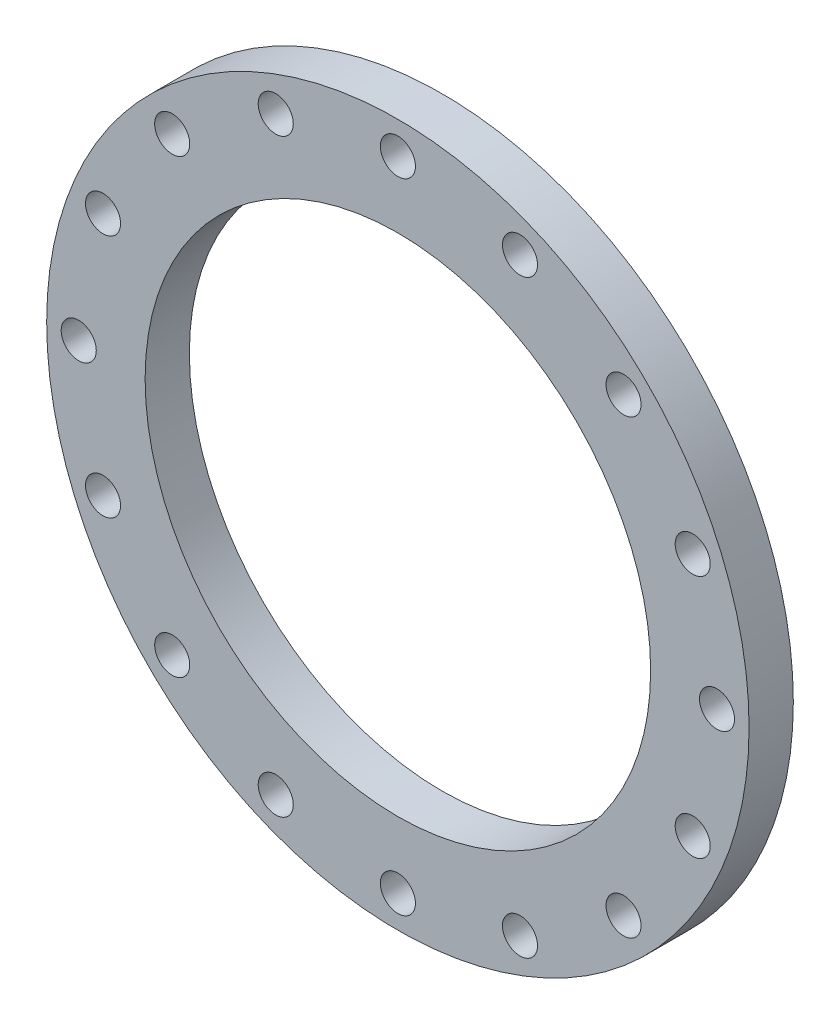
ISO-10303-21;
HEADER;
FILE_DESCRIPTION(('STEP AP214'),'2;1');
FILE_NAME('part.step','',(''),(''),'','','');
FILE_SCHEMA(('AUTOMOTIVE_DESIGN { 1 0 10303 214 1 1 1 1 }'));
ENDSEC;
DATA;
#1=APPLICATION_CONTEXT('core data for automotive mechanical design processes');
#2=APPLICATION_PROTOCOL_DEFINITION('international standard','automotive_design',2000,#1);
#3=PRODUCT_CONTEXT('',#1,'mechanical');
#4=PRODUCT('Part','Part','',(#3));
#5=PRODUCT_RELATED_PRODUCT_CATEGORY('part','',(#4));
#6=PRODUCT_DEFINITION_FORMATION('','',#4);
#7=PRODUCT_DEFINITION_CONTEXT('part definition',#1,'design');
#8=PRODUCT_DEFINITION('design','',#6,#7);
#9=PRODUCT_DEFINITION_SHAPE('','',#8);
#10=(LENGTH_UNIT() NAMED_UNIT(*) SI_UNIT(.MILLI.,.METRE.));
#11=(NAMED_UNIT(*) PLANE_ANGLE_UNIT() SI_UNIT($,.RADIAN.));
#12=(NAMED_UNIT(*) SI_UNIT($,.STERADIAN.) SOLID_ANGLE_UNIT());
#13=UNCERTAINTY_MEASURE_WITH_UNIT(LENGTH_MEASURE(1.E-05),#10,'distance_accuracy_value','');
#14=(GEOMETRIC_REPRESENTATION_CONTEXT(3) GLOBAL_UNCERTAINTY_ASSIGNED_CONTEXT((#13)) GLOBAL_UNIT_ASSIGNED_CONTEXT((#10,
#11,#12)) REPRESENTATION_CONTEXT('',''));
#15=CARTESIAN_POINT('',(0.,0.,0.));
#16=DIRECTION('',(0.,0.,1.));
#17=DIRECTION('',(1.,0.,0.));
#18=AXIS2_PLACEMENT_3D('',#15,#16,#17);
#19=CARTESIAN_POINT('',(0.,0.,40.));
#20=DIRECTION('',(0.,0.,1.));
#21=DIRECTION('',(1.,0.,0.));
#22=AXIS2_PLACEMENT_3D('',#19,#20,#21);
#23=PLANE('',#22);
#24=CARTESIAN_POINT('',(-204.000306372319,204.000306372319,40.));
#25=DIRECTION('',(0.,0.,1.));
#26=DIRECTION('',(1.,0.,0.));
#27=AXIS2_PLACEMENT_3D('',#24,#25,#26);
#28=CIRCLE('',#27,15.85);
#29=CARTESIAN_POINT('',(-188.150306372319,204.000306372319,40.));
#30=VERTEX_POINT('',#29);
#31=EDGE_CURVE('E134',#30,#30,#28,.T.);
#32=ORIENTED_EDGE('',*,*,#31,.F.);
#33=EDGE_LOOP('',(#32));
#34=FACE_BOUND('',#33,.T.);
#35=CARTESIAN_POINT('',(-288.5,0.,40.));
#36=DIRECTION('',(0.,0.,1.));
#37=DIRECTION('',(1.,0.,0.));
#38=AXIS2_PLACEMENT_3D('',#35,#36,#37);
#39=CIRCLE('',#38,15.85);
#40=CARTESIAN_POINT('',(-272.65,0.,40.));
#41=VERTEX_POINT('',#40);
#42=EDGE_CURVE('E122',#41,#41,#39,.T.);
#43=ORIENTED_EDGE('',*,*,#42,.F.);
#44=EDGE_LOOP('',(#43));
#45=FACE_BOUND('',#44,.T.);
#46=CARTESIAN_POINT('',(-204.000306372319,-204.000306372319,40.));
#47=DIRECTION('',(0.,0.,1.));
#48=DIRECTION('',(1.,0.,0.));
#49=AXIS2_PLACEMENT_3D('',#46,#47,#48);
#50=CIRCLE('',#49,15.85);
#51=CARTESIAN_POINT('',(-188.150306372319,-204.000306372319,40.));
#52=VERTEX_POINT('',#51);
#53=EDGE_CURVE('E110',#52,#52,#50,.T.);
#54=ORIENTED_EDGE('',*,*,#53,.F.);
#55=EDGE_LOOP('',(#54));
#56=FACE_BOUND('',#55,.T.);
#57=CARTESIAN_POINT('',(1.63931368479808E-13,-288.5,40.));
#58=DIRECTION('',(0.,0.,1.));
#59=DIRECTION('',(1.,0.,0.));
#60=AXIS2_PLACEMENT_3D('',#57,#58,#59);
#61=CIRCLE('',#60,15.85);
#62=CARTESIAN_POINT('',(15.8500000000002,-288.5,40.));
#63=VERTEX_POINT('',#62);
#64=EDGE_CURVE('E98',#63,#63,#61,.T.);
#65=ORIENTED_EDGE('',*,*,#64,.F.);
#66=EDGE_LOOP('',(#65));
#67=FACE_BOUND('',#66,.T.);
#68=CARTESIAN_POINT('',(204.000306372319,-204.000306372319,40.));
#69=DIRECTION('',(0.,0.,1.));
#70=DIRECTION('',(1.,0.,0.));
#71=AXIS2_PLACEMENT_3D('',#68,#69,#70);
#72=CIRCLE('',#71,15.85);
#73=CARTESIAN_POINT('',(219.850306372319,-204.000306372319,40.));
#74=VERTEX_POINT('',#73);
#75=EDGE_CURVE('E86',#74,#74,#72,.T.);
#76=ORIENTED_EDGE('',*,*,#75,.F.);
#77=EDGE_LOOP('',(#76));
#78=FACE_BOUND('',#77,.T.);
#79=CARTESIAN_POINT('',(288.5,0.,40.));
#80=DIRECTION('',(0.,0.,1.));
#81=DIRECTION('',(1.,0.,0.));
#82=AXIS2_PLACEMENT_3D('',#79,#80,#81);
#83=CIRCLE('',#82,15.8499999999999);
#84=CARTESIAN_POINT('',(304.35,0.,40.));
#85=VERTEX_POINT('',#84);
#86=EDGE_CURVE('E74',#85,#85,#83,.T.);
#87=ORIENTED_EDGE('',*,*,#86,.F.);
#88=EDGE_LOOP('',(#87));
#89=FACE_BOUND('',#88,.T.);
#90=CARTESIAN_POINT('',(204.000306372319,204.000306372319,40.));
#91=DIRECTION('',(0.,0.,1.));
#92=DIRECTION('',(1.,0.,0.));
#93=AXIS2_PLACEMENT_3D('',#90,#91,#92);
#94=CIRCLE('',#93,15.85);
#95=CARTESIAN_POINT('',(219.850306372319,204.000306372319,40.));
#96=VERTEX_POINT('',#95);
#97=EDGE_CURVE('E62',#96,#96,#94,.T.);
#98=ORIENTED_EDGE('',*,*,#97,.F.);
#99=EDGE_LOOP('',(#98));
#100=FACE_BOUND('',#99,.T.);
#101=CARTESIAN_POINT('',(0.,288.5,40.));
#102=DIRECTION('',(0.,0.,1.));
#103=DIRECTION('',(1.,0.,0.));
#104=AXIS2_PLACEMENT_3D('',#101,#102,#103);
#105=CIRCLE('',#104,15.85);
#106=CARTESIAN_POINT('',(15.85,288.5,40.));
#107=VERTEX_POINT('',#106);
#108=EDGE_CURVE('E50',#107,#107,#105,.T.);
#109=ORIENTED_EDGE('',*,*,#108,.F.);
#110=EDGE_LOOP('',(#109));
#111=FACE_BOUND('',#110,.T.);
#112=CARTESIAN_POINT('',(0.,0.,40.));
#113=DIRECTION('',(0.,0.,1.));
#114=DIRECTION('',(1.,0.,0.));
#115=AXIS2_PLACEMENT_3D('',#112,#113,#114);
#116=CIRCLE('',#115,317.5);
#117=CARTESIAN_POINT('',(317.5,0.,40.));
#118=VERTEX_POINT('',#117);
#119=EDGE_CURVE('E10',#118,#118,#116,.T.);
#120=ORIENTED_EDGE('',*,*,#119,.T.);
#121=EDGE_LOOP('',(#120));
#122=FACE_BOUND('',#121,.T.);
#123=CARTESIAN_POINT('',(0.,0.,40.));
#124=DIRECTION('',(0.,0.,1.));
#125=DIRECTION('',(1.,0.,0.));
#126=AXIS2_PLACEMENT_3D('',#123,#124,#125);
#127=CIRCLE('',#126,228.5);
#128=CARTESIAN_POINT('',(228.5,0.,40.));
#129=VERTEX_POINT('',#128);
#130=EDGE_CURVE('E45',#129,#129,#127,.T.);
#131=ORIENTED_EDGE('',*,*,#130,.F.);
#132=EDGE_LOOP('',(#131));
#133=FACE_BOUND('',#132,.T.);
#134=CARTESIAN_POINT('',(110.404170237328,266.539245129506,40.));
#135=DIRECTION('',(0.,0.,1.));
#136=DIRECTION('',(1.,0.,0.));
#137=AXIS2_PLACEMENT_3D('',#134,#135,#136);
#138=CIRCLE('',#137,15.85);
#139=CARTESIAN_POINT('',(126.254170237328,266.539245129506,40.));
#140=VERTEX_POINT('',#139);
#141=EDGE_CURVE('E56',#140,#140,#138,.T.);
#142=ORIENTED_EDGE('',*,*,#141,.F.);
#143=EDGE_LOOP('',(#142));
#144=FACE_BOUND('',#143,.T.);
#145=CARTESIAN_POINT('',(266.539245129506,110.404170237328,40.));
#146=DIRECTION('',(0.,0.,1.));
#147=DIRECTION('',(1.,0.,0.));
#148=AXIS2_PLACEMENT_3D('',#145,#146,#147);
#149=CIRCLE('',#148,15.85);
#150=CARTESIAN_POINT('',(282.389245129506,110.404170237328,40.));
#151=VERTEX_POINT('',#150);
#152=EDGE_CURVE('E68',#151,#151,#149,.T.);
#153=ORIENTED_EDGE('',*,*,#152,.F.);
#154=EDGE_LOOP('',(#153));
#155=FACE_BOUND('',#154,.T.);
#156=CARTESIAN_POINT('',(266.539245129506,-110.404170237328,40.));
#157=DIRECTION('',(0.,0.,1.));
#158=DIRECTION('',(1.,0.,0.));
#159=AXIS2_PLACEMENT_3D('',#156,#157,#158);
#160=CIRCLE('',#159,15.85);
#161=CARTESIAN_POINT('',(282.389245129506,-110.404170237328,40.));
#162=VERTEX_POINT('',#161);
#163=EDGE_CURVE('E80',#162,#162,#160,.T.);
#164=ORIENTED_EDGE('',*,*,#163,.F.);
#165=EDGE_LOOP('',(#164));
#166=FACE_BOUND('',#165,.T.);
#167=CARTESIAN_POINT('',(110.404170237329,-266.539245129506,40.));
#168=DIRECTION('',(0.,0.,1.));
#169=DIRECTION('',(1.,0.,0.));
#170=AXIS2_PLACEMENT_3D('',#167,#168,#169);
#171=CIRCLE('',#170,15.85);
#172=CARTESIAN_POINT('',(126.254170237329,-266.539245129506,40.));
#173=VERTEX_POINT('',#172);
#174=EDGE_CURVE('E92',#173,#173,#171,.T.);
#175=ORIENTED_EDGE('',*,*,#174,.F.);
#176=EDGE_LOOP('',(#175));
#177=FACE_BOUND('',#176,.T.);
#178=CARTESIAN_POINT('',(-110.404170237328,-266.539245129506,40.));
#179=DIRECTION('',(0.,0.,1.));
#180=DIRECTION('',(1.,0.,0.));
#181=AXIS2_PLACEMENT_3D('',#178,#179,#180);
#182=CIRCLE('',#181,15.85);
#183=CARTESIAN_POINT('',(-94.5541702373282,-266.539245129506,40.));
#184=VERTEX_POINT('',#183);
#185=EDGE_CURVE('E104',#184,#184,#182,.T.);
#186=ORIENTED_EDGE('',*,*,#185,.F.);
#187=EDGE_LOOP('',(#186));
#188=FACE_BOUND('',#187,.T.);
#189=CARTESIAN_POINT('',(-266.539245129506,-110.404170237329,40.));
#190=DIRECTION('',(0.,0.,1.));
#191=DIRECTION('',(1.,0.,0.));
#192=AXIS2_PLACEMENT_3D('',#189,#190,#191);
#193=CIRCLE('',#192,15.8499999999999);
#194=CARTESIAN_POINT('',(-250.689245129506,-110.404170237329,40.));
#195=VERTEX_POINT('',#194);
#196=EDGE_CURVE('E116',#195,#195,#193,.T.);
#197=ORIENTED_EDGE('',*,*,#196,.F.);
#198=EDGE_LOOP('',(#197));
#199=FACE_BOUND('',#198,.T.);
#200=CARTESIAN_POINT('',(-266.539245129506,110.404170237328,40.));
#201=DIRECTION('',(0.,0.,1.));
#202=DIRECTION('',(1.,0.,0.));
#203=AXIS2_PLACEMENT_3D('',#200,#201,#202);
#204=CIRCLE('',#203,15.8499999999999);
#205=CARTESIAN_POINT('',(-250.689245129506,110.404170237328,40.));
#206=VERTEX_POINT('',#205);
#207=EDGE_CURVE('E128',#206,#206,#204,.T.);
#208=ORIENTED_EDGE('',*,*,#207,.F.);
#209=EDGE_LOOP('',(#208));
#210=FACE_BOUND('',#209,.T.);
#211=CARTESIAN_POINT('',(-110.404170237329,266.539245129506,40.));
#212=DIRECTION('',(0.,0.,1.));
#213=DIRECTION('',(1.,0.,0.));
#214=AXIS2_PLACEMENT_3D('',#211,#212,#213);
#215=CIRCLE('',#214,15.85);
#216=CARTESIAN_POINT('',(-94.5541702373286,266.539245129506,40.));
#217=VERTEX_POINT('',#216);
#218=EDGE_CURVE('E140',#217,#217,#215,.T.);
#219=ORIENTED_EDGE('',*,*,#218,.F.);
#220=EDGE_LOOP('',(#219));
#221=FACE_BOUND('',#220,.T.);
#222=ADVANCED_FACE('F34',(#34,#45,#56,#67,#78,#89,#100,#111,#122,#133,#144,#155,#166,#177,#188,
#199,#210,#221),#23,.T.);
#223=CARTESIAN_POINT('',(0.,0.,0.));
#224=DIRECTION('',(0.,0.,1.));
#225=DIRECTION('',(1.,0.,0.));
#226=AXIS2_PLACEMENT_3D('',#223,#224,#225);
#227=PLANE('',#226);
#228=CARTESIAN_POINT('',(0.,0.,0.));
#229=DIRECTION('',(0.,0.,1.));
#230=DIRECTION('',(1.,0.,0.));
#231=AXIS2_PLACEMENT_3D('',#228,#229,#230);
#232=CIRCLE('',#231,317.5);
#233=CARTESIAN_POINT('',(317.5,0.,0.));
#234=VERTEX_POINT('',#233);
#235=EDGE_CURVE('E38',#234,#234,#232,.T.);
#236=ORIENTED_EDGE('',*,*,#235,.F.);
#237=EDGE_LOOP('',(#236));
#238=FACE_BOUND('',#237,.T.);
#239=CARTESIAN_POINT('',(0.,0.,0.));
#240=DIRECTION('',(0.,0.,1.));
#241=DIRECTION('',(1.,0.,0.));
#242=AXIS2_PLACEMENT_3D('',#239,#240,#241);
#243=CIRCLE('',#242,228.5);
#244=CARTESIAN_POINT('',(228.5,0.,0.));
#245=VERTEX_POINT('',#244);
#246=EDGE_CURVE('E47',#245,#245,#243,.T.);
#247=ORIENTED_EDGE('',*,*,#246,.T.);
#248=EDGE_LOOP('',(#247));
#249=FACE_BOUND('',#248,.T.);
#250=CARTESIAN_POINT('',(0.,288.5,0.));
#251=DIRECTION('',(0.,0.,1.));
#252=DIRECTION('',(1.,0.,0.));
#253=AXIS2_PLACEMENT_3D('',#250,#251,#252);
#254=CIRCLE('',#253,15.85);
#255=CARTESIAN_POINT('',(15.85,288.5,0.));
#256=VERTEX_POINT('',#255);
#257=EDGE_CURVE('E53',#256,#256,#254,.T.);
#258=ORIENTED_EDGE('',*,*,#257,.T.);
#259=EDGE_LOOP('',(#258));
#260=FACE_BOUND('',#259,.T.);
#261=CARTESIAN_POINT('',(110.404170237328,266.539245129506,0.));
#262=DIRECTION('',(0.,0.,1.));
#263=DIRECTION('',(1.,0.,0.));
#264=AXIS2_PLACEMENT_3D('',#261,#262,#263);
#265=CIRCLE('',#264,15.85);
#266=CARTESIAN_POINT('',(126.254170237328,266.539245129506,0.));
#267=VERTEX_POINT('',#266);
#268=EDGE_CURVE('E59',#267,#267,#265,.T.);
#269=ORIENTED_EDGE('',*,*,#268,.T.);
#270=EDGE_LOOP('',(#269));
#271=FACE_BOUND('',#270,.T.);
#272=CARTESIAN_POINT('',(204.000306372319,204.000306372319,0.));
#273=DIRECTION('',(0.,0.,1.));
#274=DIRECTION('',(1.,0.,0.));
#275=AXIS2_PLACEMENT_3D('',#272,#273,#274);
#276=CIRCLE('',#275,15.85);
#277=CARTESIAN_POINT('',(219.850306372319,204.000306372319,0.));
#278=VERTEX_POINT('',#277);
#279=EDGE_CURVE('E65',#278,#278,#276,.T.);
#280=ORIENTED_EDGE('',*,*,#279,.T.);
#281=EDGE_LOOP('',(#280));
#282=FACE_BOUND('',#281,.T.);
#283=CARTESIAN_POINT('',(266.539245129506,110.404170237328,0.));
#284=DIRECTION('',(0.,0.,1.));
#285=DIRECTION('',(1.,0.,0.));
#286=AXIS2_PLACEMENT_3D('',#283,#284,#285);
#287=CIRCLE('',#286,15.85);
#288=CARTESIAN_POINT('',(282.389245129506,110.404170237328,0.));
#289=VERTEX_POINT('',#288);
#290=EDGE_CURVE('E71',#289,#289,#287,.T.);
#291=ORIENTED_EDGE('',*,*,#290,.T.);
#292=EDGE_LOOP('',(#291));
#293=FACE_BOUND('',#292,.T.);
#294=CARTESIAN_POINT('',(288.5,0.,0.));
#295=DIRECTION('',(0.,0.,1.));
#296=DIRECTION('',(1.,0.,0.));
#297=AXIS2_PLACEMENT_3D('',#294,#295,#296);
#298=CIRCLE('',#297,15.8499999999999);
#299=CARTESIAN_POINT('',(304.35,0.,0.));
#300=VERTEX_POINT('',#299);
#301=EDGE_CURVE('E77',#300,#300,#298,.T.);
#302=ORIENTED_EDGE('',*,*,#301,.T.);
#303=EDGE_LOOP('',(#302));
#304=FACE_BOUND('',#303,.T.);
#305=CARTESIAN_POINT('',(266.539245129506,-110.404170237328,0.));
#306=DIRECTION('',(0.,0.,1.));
#307=DIRECTION('',(1.,0.,0.));
#308=AXIS2_PLACEMENT_3D('',#305,#306,#307);
#309=CIRCLE('',#308,15.85);
#310=CARTESIAN_POINT('',(282.389245129506,-110.404170237328,0.));
#311=VERTEX_POINT('',#310);
#312=EDGE_CURVE('E83',#311,#311,#309,.T.);
#313=ORIENTED_EDGE('',*,*,#312,.T.);
#314=EDGE_LOOP('',(#313));
#315=FACE_BOUND('',#314,.T.);
#316=CARTESIAN_POINT('',(204.000306372319,-204.000306372319,0.));
#317=DIRECTION('',(0.,0.,1.));
#318=DIRECTION('',(1.,0.,0.));
#319=AXIS2_PLACEMENT_3D('',#316,#317,#318);
#320=CIRCLE('',#319,15.85);
#321=CARTESIAN_POINT('',(219.850306372319,-204.000306372319,0.));
#322=VERTEX_POINT('',#321);
#323=EDGE_CURVE('E89',#322,#322,#320,.T.);
#324=ORIENTED_EDGE('',*,*,#323,.T.);
#325=EDGE_LOOP('',(#324));
#326=FACE_BOUND('',#325,.T.);
#327=CARTESIAN_POINT('',(110.404170237329,-266.539245129506,0.));
#328=DIRECTION('',(0.,0.,1.));
#329=DIRECTION('',(1.,0.,0.));
#330=AXIS2_PLACEMENT_3D('',#327,#328,#329);
#331=CIRCLE('',#330,15.85);
#332=CARTESIAN_POINT('',(126.254170237329,-266.539245129506,0.));
#333=VERTEX_POINT('',#332);
#334=EDGE_CURVE('E95',#333,#333,#331,.T.);
#335=ORIENTED_EDGE('',*,*,#334,.T.);
#336=EDGE_LOOP('',(#335));
#337=FACE_BOUND('',#336,.T.);
#338=CARTESIAN_POINT('',(1.63931368479808E-13,-288.5,0.));
#339=DIRECTION('',(0.,0.,1.));
#340=DIRECTION('',(1.,0.,0.));
#341=AXIS2_PLACEMENT_3D('',#338,#339,#340);
#342=CIRCLE('',#341,15.85);
#343=CARTESIAN_POINT('',(15.8500000000002,-288.5,0.));
#344=VERTEX_POINT('',#343);
#345=EDGE_CURVE('E101',#344,#344,#342,.T.);
#346=ORIENTED_EDGE('',*,*,#345,.T.);
#347=EDGE_LOOP('',(#346));
#348=FACE_BOUND('',#347,.T.);
#349=CARTESIAN_POINT('',(-110.404170237328,-266.539245129506,0.));
#350=DIRECTION('',(0.,0.,1.));
#351=DIRECTION('',(1.,0.,0.));
#352=AXIS2_PLACEMENT_3D('',#349,#350,#351);
#353=CIRCLE('',#352,15.85);
#354=CARTESIAN_POINT('',(-94.5541702373282,-266.539245129506,0.));
#355=VERTEX_POINT('',#354);
#356=EDGE_CURVE('E107',#355,#355,#353,.T.);
#357=ORIENTED_EDGE('',*,*,#356,.T.);
#358=EDGE_LOOP('',(#357));
#359=FACE_BOUND('',#358,.T.);
#360=CARTESIAN_POINT('',(-204.000306372319,-204.000306372319,0.));
#361=DIRECTION('',(0.,0.,1.));
#362=DIRECTION('',(1.,0.,0.));
#363=AXIS2_PLACEMENT_3D('',#360,#361,#362);
#364=CIRCLE('',#363,15.85);
#365=CARTESIAN_POINT('',(-188.150306372319,-204.000306372319,0.));
#366=VERTEX_POINT('',#365);
#367=EDGE_CURVE('E113',#366,#366,#364,.T.);
#368=ORIENTED_EDGE('',*,*,#367,.T.);
#369=EDGE_LOOP('',(#368));
#370=FACE_BOUND('',#369,.T.);
#371=CARTESIAN_POINT('',(-266.539245129506,-110.404170237329,0.));
#372=DIRECTION('',(0.,0.,1.));
#373=DIRECTION('',(1.,0.,0.));
#374=AXIS2_PLACEMENT_3D('',#371,#372,#373);
#375=CIRCLE('',#374,15.8499999999999);
#376=CARTESIAN_POINT('',(-250.689245129506,-110.404170237329,0.));
#377=VERTEX_POINT('',#376);
#378=EDGE_CURVE('E119',#377,#377,#375,.T.);
#379=ORIENTED_EDGE('',*,*,#378,.T.);
#380=EDGE_LOOP('',(#379));
#381=FACE_BOUND('',#380,.T.);
#382=CARTESIAN_POINT('',(-288.5,0.,0.));
#383=DIRECTION('',(0.,0.,1.));
#384=DIRECTION('',(1.,0.,0.));
#385=AXIS2_PLACEMENT_3D('',#382,#383,#384);
#386=CIRCLE('',#385,15.85);
#387=CARTESIAN_POINT('',(-272.65,0.,0.));
#388=VERTEX_POINT('',#387);
#389=EDGE_CURVE('E125',#388,#388,#386,.T.);
#390=ORIENTED_EDGE('',*,*,#389,.T.);
#391=EDGE_LOOP('',(#390));
#392=FACE_BOUND('',#391,.T.);
#393=CARTESIAN_POINT('',(-266.539245129506,110.404170237328,0.));
#394=DIRECTION('',(0.,0.,1.));
#395=DIRECTION('',(1.,0.,0.));
#396=AXIS2_PLACEMENT_3D('',#393,#394,#395);
#397=CIRCLE('',#396,15.8499999999999);
#398=CARTESIAN_POINT('',(-250.689245129506,110.404170237328,0.));
#399=VERTEX_POINT('',#398);
#400=EDGE_CURVE('E131',#399,#399,#397,.T.);
#401=ORIENTED_EDGE('',*,*,#400,.T.);
#402=EDGE_LOOP('',(#401));
#403=FACE_BOUND('',#402,.T.);
#404=CARTESIAN_POINT('',(-204.000306372319,204.000306372319,0.));
#405=DIRECTION('',(0.,0.,1.));
#406=DIRECTION('',(1.,0.,0.));
#407=AXIS2_PLACEMENT_3D('',#404,#405,#406);
#408=CIRCLE('',#407,15.85);
#409=CARTESIAN_POINT('',(-188.150306372319,204.000306372319,0.));
#410=VERTEX_POINT('',#409);
#411=EDGE_CURVE('E137',#410,#410,#408,.T.);
#412=ORIENTED_EDGE('',*,*,#411,.T.);
#413=EDGE_LOOP('',(#412));
#414=FACE_BOUND('',#413,.T.);
#415=CARTESIAN_POINT('',(-110.404170237329,266.539245129506,0.));
#416=DIRECTION('',(0.,0.,1.));
#417=DIRECTION('',(1.,0.,0.));
#418=AXIS2_PLACEMENT_3D('',#415,#416,#417);
#419=CIRCLE('',#418,15.85);
#420=CARTESIAN_POINT('',(-94.5541702373286,266.539245129506,0.));
#421=VERTEX_POINT('',#420);
#422=EDGE_CURVE('E143',#421,#421,#419,.T.);
#423=ORIENTED_EDGE('',*,*,#422,.T.);
#424=EDGE_LOOP('',(#423));
#425=FACE_BOUND('',#424,.T.);
#426=ADVANCED_FACE('F153',(#238,#249,#260,#271,#282,#293,#304,#315,#326,#337,#348,#359,#370,
#381,#392,#403,#414,#425),#227,.F.);
#427=CARTESIAN_POINT('',(0.,0.,40.));
#428=DIRECTION('',(0.,0.,-1.));
#429=DIRECTION('',(-1.,0.,0.));
#430=AXIS2_PLACEMENT_3D('',#427,#428,#429);
#431=CYLINDRICAL_SURFACE('',#430,317.5);
#432=ORIENTED_EDGE('',*,*,#119,.F.);
#433=EDGE_LOOP('',(#432));
#434=FACE_BOUND('',#433,.T.);
#435=ORIENTED_EDGE('',*,*,#235,.T.);
#436=EDGE_LOOP('',(#435));
#437=FACE_BOUND('',#436,.T.);
#438=ADVANCED_FACE('F36',(#434,#437),#431,.T.);
#439=CARTESIAN_POINT('',(0.,0.,40.));
#440=DIRECTION('',(0.,0.,-1.));
#441=DIRECTION('',(-1.,0.,0.));
#442=AXIS2_PLACEMENT_3D('',#439,#440,#441);
#443=CYLINDRICAL_SURFACE('',#442,228.5);
#444=ORIENTED_EDGE('',*,*,#130,.T.);
#445=EDGE_LOOP('',(#444));
#446=FACE_BOUND('',#445,.T.);
#447=ORIENTED_EDGE('',*,*,#246,.F.);
#448=EDGE_LOOP('',(#447));
#449=FACE_BOUND('',#448,.T.);
#450=ADVANCED_FACE('F163',(#446,#449),#443,.F.);
#451=CARTESIAN_POINT('',(0.,288.5,40.));
#452=DIRECTION('',(0.,0.,-1.));
#453=DIRECTION('',(-1.,0.,0.));
#454=AXIS2_PLACEMENT_3D('',#451,#452,#453);
#455=CYLINDRICAL_SURFACE('',#454,15.85);
#456=ORIENTED_EDGE('',*,*,#108,.T.);
#457=EDGE_LOOP('',(#456));
#458=FACE_BOUND('',#457,.T.);
#459=ORIENTED_EDGE('',*,*,#257,.F.);
#460=EDGE_LOOP('',(#459));
#461=FACE_BOUND('',#460,.T.);
#462=ADVANCED_FACE('F166',(#458,#461),#455,.F.);
#463=CARTESIAN_POINT('',(110.404170237328,266.539245129506,40.));
#464=DIRECTION('',(0.,0.,-1.));
#465=DIRECTION('',(-1.,0.,0.));
#466=AXIS2_PLACEMENT_3D('',#463,#464,#465);
#467=CYLINDRICAL_SURFACE('',#466,15.85);
#468=ORIENTED_EDGE('',*,*,#141,.T.);
#469=EDGE_LOOP('',(#468));
#470=FACE_BOUND('',#469,.T.);
#471=ORIENTED_EDGE('',*,*,#268,.F.);
#472=EDGE_LOOP('',(#471));
#473=FACE_BOUND('',#472,.T.);
#474=ADVANCED_FACE('F170',(#470,#473),#467,.F.);
#475=CARTESIAN_POINT('',(204.000306372319,204.000306372319,40.));
#476=DIRECTION('',(0.,0.,-1.));
#477=DIRECTION('',(-1.,0.,0.));
#478=AXIS2_PLACEMENT_3D('',#475,#476,#477);
#479=CYLINDRICAL_SURFACE('',#478,15.85);
#480=ORIENTED_EDGE('',*,*,#97,.T.);
#481=EDGE_LOOP('',(#480));
#482=FACE_BOUND('',#481,.T.);
#483=ORIENTED_EDGE('',*,*,#279,.F.);
#484=EDGE_LOOP('',(#483));
#485=FACE_BOUND('',#484,.T.);
#486=ADVANCED_FACE('F174',(#482,#485),#479,.F.);
#487=CARTESIAN_POINT('',(266.539245129506,110.404170237328,40.));
#488=DIRECTION('',(0.,0.,-1.));
#489=DIRECTION('',(-1.,0.,0.));
#490=AXIS2_PLACEMENT_3D('',#487,#488,#489);
#491=CYLINDRICAL_SURFACE('',#490,15.85);
#492=ORIENTED_EDGE('',*,*,#152,.T.);
#493=EDGE_LOOP('',(#492));
#494=FACE_BOUND('',#493,.T.);
#495=ORIENTED_EDGE('',*,*,#290,.F.);
#496=EDGE_LOOP('',(#495));
#497=FACE_BOUND('',#496,.T.);
#498=ADVANCED_FACE('F178',(#494,#497),#491,.F.);
#499=CARTESIAN_POINT('',(288.5,0.,40.));
#500=DIRECTION('',(0.,0.,-1.));
#501=DIRECTION('',(-1.,0.,0.));
#502=AXIS2_PLACEMENT_3D('',#499,#500,#501);
#503=CYLINDRICAL_SURFACE('',#502,15.8499999999999);
#504=ORIENTED_EDGE('',*,*,#86,.T.);
#505=EDGE_LOOP('',(#504));
#506=FACE_BOUND('',#505,.T.);
#507=ORIENTED_EDGE('',*,*,#301,.F.);
#508=EDGE_LOOP('',(#507));
#509=FACE_BOUND('',#508,.T.);
#510=ADVANCED_FACE('F182',(#506,#509),#503,.F.);
#511=CARTESIAN_POINT('',(266.539245129506,-110.404170237328,40.));
#512=DIRECTION('',(0.,0.,-1.));
#513=DIRECTION('',(-1.,0.,0.));
#514=AXIS2_PLACEMENT_3D('',#511,#512,#513);
#515=CYLINDRICAL_SURFACE('',#514,15.85);
#516=ORIENTED_EDGE('',*,*,#163,.T.);
#517=EDGE_LOOP('',(#516));
#518=FACE_BOUND('',#517,.T.);
#519=ORIENTED_EDGE('',*,*,#312,.F.);
#520=EDGE_LOOP('',(#519));
#521=FACE_BOUND('',#520,.T.);
#522=ADVANCED_FACE('F186',(#518,#521),#515,.F.);
#523=CARTESIAN_POINT('',(204.000306372319,-204.000306372319,40.));
#524=DIRECTION('',(0.,0.,-1.));
#525=DIRECTION('',(-1.,0.,0.));
#526=AXIS2_PLACEMENT_3D('',#523,#524,#525);
#527=CYLINDRICAL_SURFACE('',#526,15.85);
#528=ORIENTED_EDGE('',*,*,#75,.T.);
#529=EDGE_LOOP('',(#528));
#530=FACE_BOUND('',#529,.T.);
#531=ORIENTED_EDGE('',*,*,#323,.F.);
#532=EDGE_LOOP('',(#531));
#533=FACE_BOUND('',#532,.T.);
#534=ADVANCED_FACE('F190',(#530,#533),#527,.F.);
#535=CARTESIAN_POINT('',(110.404170237329,-266.539245129506,40.));
#536=DIRECTION('',(0.,0.,-1.));
#537=DIRECTION('',(-1.,0.,0.));
#538=AXIS2_PLACEMENT_3D('',#535,#536,#537);
#539=CYLINDRICAL_SURFACE('',#538,15.85);
#540=ORIENTED_EDGE('',*,*,#174,.T.);
#541=EDGE_LOOP('',(#540));
#542=FACE_BOUND('',#541,.T.);
#543=ORIENTED_EDGE('',*,*,#334,.F.);
#544=EDGE_LOOP('',(#543));
#545=FACE_BOUND('',#544,.T.);
#546=ADVANCED_FACE('F194',(#542,#545),#539,.F.);
#547=CARTESIAN_POINT('',(1.63931368479808E-13,-288.5,40.));
#548=DIRECTION('',(0.,0.,-1.));
#549=DIRECTION('',(-1.,0.,0.));
#550=AXIS2_PLACEMENT_3D('',#547,#548,#549);
#551=CYLINDRICAL_SURFACE('',#550,15.85);
#552=ORIENTED_EDGE('',*,*,#64,.T.);
#553=EDGE_LOOP('',(#552));
#554=FACE_BOUND('',#553,.T.);
#555=ORIENTED_EDGE('',*,*,#345,.F.);
#556=EDGE_LOOP('',(#555));
#557=FACE_BOUND('',#556,.T.);
#558=ADVANCED_FACE('F198',(#554,#557),#551,.F.);
#559=CARTESIAN_POINT('',(-110.404170237328,-266.539245129506,40.));
#560=DIRECTION('',(0.,0.,-1.));
#561=DIRECTION('',(-1.,0.,0.));
#562=AXIS2_PLACEMENT_3D('',#559,#560,#561);
#563=CYLINDRICAL_SURFACE('',#562,15.85);
#564=ORIENTED_EDGE('',*,*,#185,.T.);
#565=EDGE_LOOP('',(#564));
#566=FACE_BOUND('',#565,.T.);
#567=ORIENTED_EDGE('',*,*,#356,.F.);
#568=EDGE_LOOP('',(#567));
#569=FACE_BOUND('',#568,.T.);
#570=ADVANCED_FACE('F202',(#566,#569),#563,.F.);
#571=CARTESIAN_POINT('',(-204.000306372319,-204.000306372319,40.));
#572=DIRECTION('',(0.,0.,-1.));
#573=DIRECTION('',(-1.,0.,0.));
#574=AXIS2_PLACEMENT_3D('',#571,#572,#573);
#575=CYLINDRICAL_SURFACE('',#574,15.85);
#576=ORIENTED_EDGE('',*,*,#53,.T.);
#577=EDGE_LOOP('',(#576));
#578=FACE_BOUND('',#577,.T.);
#579=ORIENTED_EDGE('',*,*,#367,.F.);
#580=EDGE_LOOP('',(#579));
#581=FACE_BOUND('',#580,.T.);
#582=ADVANCED_FACE('F206',(#578,#581),#575,.F.);
#583=CARTESIAN_POINT('',(-266.539245129506,-110.404170237329,40.));
#584=DIRECTION('',(0.,0.,-1.));
#585=DIRECTION('',(-1.,0.,0.));
#586=AXIS2_PLACEMENT_3D('',#583,#584,#585);
#587=CYLINDRICAL_SURFACE('',#586,15.8499999999999);
#588=ORIENTED_EDGE('',*,*,#196,.T.);
#589=EDGE_LOOP('',(#588));
#590=FACE_BOUND('',#589,.T.);
#591=ORIENTED_EDGE('',*,*,#378,.F.);
#592=EDGE_LOOP('',(#591));
#593=FACE_BOUND('',#592,.T.);
#594=ADVANCED_FACE('F210',(#590,#593),#587,.F.);
#595=CARTESIAN_POINT('',(-288.5,0.,40.));
#596=DIRECTION('',(0.,0.,-1.));
#597=DIRECTION('',(-1.,0.,0.));
#598=AXIS2_PLACEMENT_3D('',#595,#596,#597);
#599=CYLINDRICAL_SURFACE('',#598,15.85);
#600=ORIENTED_EDGE('',*,*,#42,.T.);
#601=EDGE_LOOP('',(#600));
#602=FACE_BOUND('',#601,.T.);
#603=ORIENTED_EDGE('',*,*,#389,.F.);
#604=EDGE_LOOP('',(#603));
#605=FACE_BOUND('',#604,.T.);
#606=ADVANCED_FACE('F214',(#602,#605),#599,.F.);
#607=CARTESIAN_POINT('',(-266.539245129506,110.404170237328,40.));
#608=DIRECTION('',(0.,0.,-1.));
#609=DIRECTION('',(-1.,0.,0.));
#610=AXIS2_PLACEMENT_3D('',#607,#608,#609);
#611=CYLINDRICAL_SURFACE('',#610,15.8499999999999);
#612=ORIENTED_EDGE('',*,*,#207,.T.);
#613=EDGE_LOOP('',(#612));
#614=FACE_BOUND('',#613,.T.);
#615=ORIENTED_EDGE('',*,*,#400,.F.);
#616=EDGE_LOOP('',(#615));
#617=FACE_BOUND('',#616,.T.);
#618=ADVANCED_FACE('F218',(#614,#617),#611,.F.);
#619=CARTESIAN_POINT('',(-204.000306372319,204.000306372319,40.));
#620=DIRECTION('',(0.,0.,-1.));
#621=DIRECTION('',(-1.,0.,0.));
#622=AXIS2_PLACEMENT_3D('',#619,#620,#621);
#623=CYLINDRICAL_SURFACE('',#622,15.85);
#624=ORIENTED_EDGE('',*,*,#31,.T.);
#625=EDGE_LOOP('',(#624));
#626=FACE_BOUND('',#625,.T.);
#627=ORIENTED_EDGE('',*,*,#411,.F.);
#628=EDGE_LOOP('',(#627));
#629=FACE_BOUND('',#628,.T.);
#630=ADVANCED_FACE('F222',(#626,#629),#623,.F.);
#631=CARTESIAN_POINT('',(-110.404170237329,266.539245129506,40.));
#632=DIRECTION('',(0.,0.,-1.));
#633=DIRECTION('',(-1.,0.,0.));
#634=AXIS2_PLACEMENT_3D('',#631,#632,#633);
#635=CYLINDRICAL_SURFACE('',#634,15.85);
#636=ORIENTED_EDGE('',*,*,#218,.T.);
#637=EDGE_LOOP('',(#636));
#638=FACE_BOUND('',#637,.T.);
#639=ORIENTED_EDGE('',*,*,#422,.F.);
#640=EDGE_LOOP('',(#639));
#641=FACE_BOUND('',#640,.T.);
#642=ADVANCED_FACE('F149',(#638,#641),#635,.F.);
#643=CLOSED_SHELL('',(#222,#426,#438,#450,#462,#474,#486,#498,#510,#522,#534,#546,#558,#570,
#582,#594,#606,#618,#630,#642));
#644=MANIFOLD_SOLID_BREP('B2',#643);
#645=ADVANCED_BREP_SHAPE_REPRESENTATION('',(#18,#644),#14);
#646=SHAPE_DEFINITION_REPRESENTATION(#9,#645);
ENDSEC;
END-ISO-10303-21;
